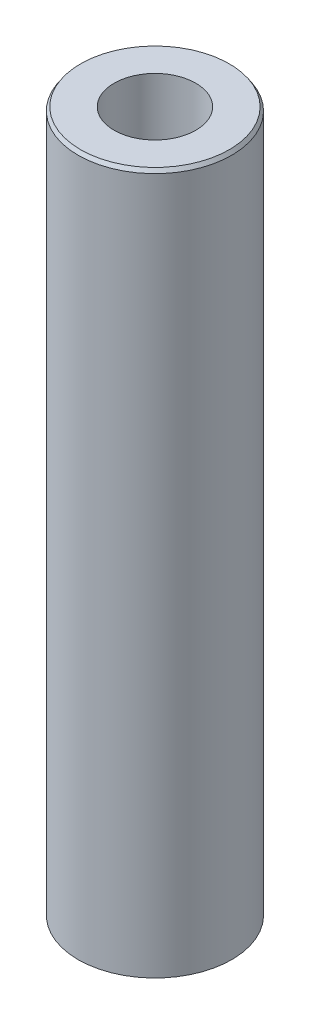
ISO-10303-21;
HEADER;
FILE_DESCRIPTION(('STEP AP214'),'2;1');
FILE_NAME('part.step','',(''),(''),'','','');
FILE_SCHEMA(('AUTOMOTIVE_DESIGN { 1 0 10303 214 1 1 1 1 }'));
ENDSEC;
DATA;
#1=APPLICATION_CONTEXT('core data for automotive mechanical design processes');
#2=APPLICATION_PROTOCOL_DEFINITION('international standard','automotive_design',2000,#1);
#3=PRODUCT_CONTEXT('',#1,'mechanical');
#4=PRODUCT('Part','Part','',(#3));
#5=PRODUCT_RELATED_PRODUCT_CATEGORY('part','',(#4));
#6=PRODUCT_DEFINITION_FORMATION('','',#4);
#7=PRODUCT_DEFINITION_CONTEXT('part definition',#1,'design');
#8=PRODUCT_DEFINITION('design','',#6,#7);
#9=PRODUCT_DEFINITION_SHAPE('','',#8);
#10=(LENGTH_UNIT() NAMED_UNIT(*) SI_UNIT(.MILLI.,.METRE.));
#11=(NAMED_UNIT(*) PLANE_ANGLE_UNIT() SI_UNIT($,.RADIAN.));
#12=(NAMED_UNIT(*) SI_UNIT($,.STERADIAN.) SOLID_ANGLE_UNIT());
#13=UNCERTAINTY_MEASURE_WITH_UNIT(LENGTH_MEASURE(1.E-05),#10,'distance_accuracy_value','');
#14=(GEOMETRIC_REPRESENTATION_CONTEXT(3) GLOBAL_UNCERTAINTY_ASSIGNED_CONTEXT((#13)) GLOBAL_UNIT_ASSIGNED_CONTEXT((#10,
#11,#12)) REPRESENTATION_CONTEXT('',''));
#15=CARTESIAN_POINT('',(0.,0.,0.));
#16=DIRECTION('',(0.,0.,1.));
#17=DIRECTION('',(1.,0.,0.));
#18=AXIS2_PLACEMENT_3D('',#15,#16,#17);
#19=CARTESIAN_POINT('',(0.,503.185772735414,0.));
#20=DIRECTION('',(0.,-1.,0.));
#21=DIRECTION('',(0.,0.,-1.));
#22=AXIS2_PLACEMENT_3D('',#19,#20,#21);
#23=CYLINDRICAL_SURFACE('',#22,55.);
#24=CARTESIAN_POINT('',(0.,500.571484464106,0.));
#25=DIRECTION('',(0.,1.,0.));
#26=DIRECTION('',(0.,0.,1.));
#27=AXIS2_PLACEMENT_3D('',#24,#25,#26);
#28=CIRCLE('',#27,55.);
#29=CARTESIAN_POINT('',(0.,500.571484464106,55.));
#30=VERTEX_POINT('',#29);
#31=EDGE_CURVE('E50',#30,#30,#28,.F.);
#32=ORIENTED_EDGE('',*,*,#31,.T.);
#33=EDGE_LOOP('',(#32));
#34=FACE_BOUND('',#33,.T.);
#35=CARTESIAN_POINT('',(0.,1.73448984605251,0.));
#36=DIRECTION('',(0.,1.,0.));
#37=DIRECTION('',(0.,0.,1.));
#38=AXIS2_PLACEMENT_3D('',#35,#36,#37);
#39=CIRCLE('',#38,55.);
#40=CARTESIAN_POINT('',(0.,1.73448984605251,55.));
#41=VERTEX_POINT('',#40);
#42=EDGE_CURVE('E51',#41,#41,#39,.T.);
#43=ORIENTED_EDGE('',*,*,#42,.T.);
#44=EDGE_LOOP('',(#43));
#45=FACE_BOUND('',#44,.T.);
#46=ADVANCED_FACE('F39',(#34,#45),#23,.T.);
#47=CARTESIAN_POINT('',(0.,503.185772735414,0.));
#48=DIRECTION('',(0.,1.,0.));
#49=DIRECTION('',(0.,0.,1.));
#50=AXIS2_PLACEMENT_3D('',#47,#48,#49);
#51=PLANE('',#50);
#52=CARTESIAN_POINT('',(0.,503.185772735414,0.));
#53=DIRECTION('',(0.,1.,0.));
#54=DIRECTION('',(0.,0.,1.));
#55=AXIS2_PLACEMENT_3D('',#52,#53,#54);
#56=CIRCLE('',#55,53.2655101539474);
#57=CARTESIAN_POINT('',(0.,503.185772735414,53.2655101539474));
#58=VERTEX_POINT('',#57);
#59=EDGE_CURVE('E54',#58,#58,#56,.T.);
#60=ORIENTED_EDGE('',*,*,#59,.T.);
#61=EDGE_LOOP('',(#60));
#62=FACE_BOUND('',#61,.T.);
#63=CARTESIAN_POINT('',(0.,503.185772735414,0.));
#64=DIRECTION('',(0.,1.,0.));
#65=DIRECTION('',(0.,0.,1.));
#66=AXIS2_PLACEMENT_3D('',#63,#64,#65);
#67=CIRCLE('',#66,29.235943878737);
#68=CARTESIAN_POINT('',(0.,503.185772735414,29.235943878737));
#69=VERTEX_POINT('',#68);
#70=EDGE_CURVE('E58',#69,#69,#67,.T.);
#71=ORIENTED_EDGE('',*,*,#70,.F.);
#72=EDGE_LOOP('',(#71));
#73=FACE_BOUND('',#72,.T.);
#74=ADVANCED_FACE('F69',(#62,#73),#51,.T.);
#75=CARTESIAN_POINT('',(0.,0.,0.));
#76=DIRECTION('',(0.,1.,0.));
#77=DIRECTION('',(0.,0.,1.));
#78=AXIS2_PLACEMENT_3D('',#75,#76,#77);
#79=PLANE('',#78);
#80=CARTESIAN_POINT('',(0.,0.,0.));
#81=DIRECTION('',(0.,1.,0.));
#82=DIRECTION('',(0.,0.,1.));
#83=AXIS2_PLACEMENT_3D('',#80,#81,#82);
#84=CIRCLE('',#83,52.3857117286925);
#85=CARTESIAN_POINT('',(0.,0.,52.3857117286925));
#86=VERTEX_POINT('',#85);
#87=EDGE_CURVE('E10',#86,#86,#84,.F.);
#88=ORIENTED_EDGE('',*,*,#87,.T.);
#89=EDGE_LOOP('',(#88));
#90=FACE_BOUND('',#89,.T.);
#91=CARTESIAN_POINT('',(0.,0.,0.));
#92=DIRECTION('',(0.,1.,0.));
#93=DIRECTION('',(0.,0.,1.));
#94=AXIS2_PLACEMENT_3D('',#91,#92,#93);
#95=CIRCLE('',#94,29.235943878737);
#96=CARTESIAN_POINT('',(0.,0.,29.235943878737));
#97=VERTEX_POINT('',#96);
#98=EDGE_CURVE('E63',#97,#97,#95,.T.);
#99=ORIENTED_EDGE('',*,*,#98,.T.);
#100=EDGE_LOOP('',(#99));
#101=FACE_BOUND('',#100,.T.);
#102=ADVANCED_FACE('F75',(#90,#101),#79,.F.);
#103=CARTESIAN_POINT('',(0.,503.185772735414,0.));
#104=DIRECTION('',(0.,-1.,0.));
#105=DIRECTION('',(0.,0.,-1.));
#106=AXIS2_PLACEMENT_3D('',#103,#104,#105);
#107=CYLINDRICAL_SURFACE('',#106,29.235943878737);
#108=ORIENTED_EDGE('',*,*,#70,.T.);
#109=EDGE_LOOP('',(#108));
#110=FACE_BOUND('',#109,.T.);
#111=ORIENTED_EDGE('',*,*,#98,.F.);
#112=EDGE_LOOP('',(#111));
#113=FACE_BOUND('',#112,.T.);
#114=ADVANCED_FACE('F70',(#110,#113),#107,.F.);
#115=CARTESIAN_POINT('',(0.,503.185772735414,0.));
#116=DIRECTION('',(0.,-1.,0.));
#117=DIRECTION('',(0.,0.,-1.));
#118=AXIS2_PLACEMENT_3D('',#115,#116,#117);
#119=CONICAL_SURFACE('',#118,53.2655101539474,0.585783074874268);
#120=ORIENTED_EDGE('',*,*,#31,.F.);
#121=EDGE_LOOP('',(#120));
#122=FACE_BOUND('',#121,.T.);
#123=ORIENTED_EDGE('',*,*,#59,.F.);
#124=EDGE_LOOP('',(#123));
#125=FACE_BOUND('',#124,.T.);
#126=ADVANCED_FACE('F81',(#122,#125),#119,.T.);
#127=CARTESIAN_POINT('',(0.,1.73448984605251,0.));
#128=DIRECTION('',(0.,1.,0.));
#129=DIRECTION('',(0.,0.,1.));
#130=AXIS2_PLACEMENT_3D('',#127,#128,#129);
#131=CONICAL_SURFACE('',#130,55.,0.985013251920641);
#132=CARTESIAN_POINT('',(0.,0.,52.3857117286925));
#133=CARTESIAN_POINT('',(0.,0.0180676025630485,52.4129438981853));
#134=CARTESIAN_POINT('',(0.,0.0361352051260949,52.4401760676781));
#135=CARTESIAN_POINT('',(0.,0.0722704102521877,52.4946404066636));
#136=CARTESIAN_POINT('',(0.,0.0903380128152341,52.5218725761564));
#137=CARTESIAN_POINT('',(0.,0.126473217941328,52.576336915142));
#138=CARTESIAN_POINT('',(0.,0.144540820504376,52.6035690846348));
#139=CARTESIAN_POINT('',(0.,0.18067602563047,52.6580334236204));
#140=CARTESIAN_POINT('',(0.,0.198743628193516,52.6852655931132));
#141=CARTESIAN_POINT('',(0.,0.23487883331961,52.7397299320987));
#142=CARTESIAN_POINT('',(0.,0.252946435882658,52.7669621015915));
#143=CARTESIAN_POINT('',(0.,0.289081641008752,52.8214264405771));
#144=CARTESIAN_POINT('',(0.,0.307149243571798,52.8486586100699));
#145=CARTESIAN_POINT('',(0.,0.343284448697892,52.9031229490554));
#146=CARTESIAN_POINT('',(0.,0.36135205126094,52.9303551185482));
#147=CARTESIAN_POINT('',(0.,0.397487256387034,52.9848194575338));
#148=CARTESIAN_POINT('',(0.,0.41555485895008,53.0120516270266));
#149=CARTESIAN_POINT('',(0.,0.451690064076174,53.0665159660122));
#150=CARTESIAN_POINT('',(0.,0.469757666639222,53.093748135505));
#151=CARTESIAN_POINT('',(0.,0.505892871765316,53.1482124744905));
#152=CARTESIAN_POINT('',(0.,0.523960474328362,53.1754446439833));
#153=CARTESIAN_POINT('',(0.,0.560095679454456,53.2299089829689));
#154=CARTESIAN_POINT('',(0.,0.578163282017504,53.2571411524617));
#155=CARTESIAN_POINT('',(0.,0.614298487143598,53.3116054914472));
#156=CARTESIAN_POINT('',(0.,0.632366089706644,53.33883766094));
#157=CARTESIAN_POINT('',(0.,0.668501294832738,53.3933019999256));
#158=CARTESIAN_POINT('',(0.,0.686568897395786,53.4205341694184));
#159=CARTESIAN_POINT('',(0.,0.72270410252188,53.474998508404));
#160=CARTESIAN_POINT('',(0.,0.740771705084926,53.5022306778967));
#161=CARTESIAN_POINT('',(0.,0.77690691021102,53.5566950168823));
#162=CARTESIAN_POINT('',(0.,0.794974512774068,53.5839271863751));
#163=CARTESIAN_POINT('',(0.,0.831109717900162,53.6383915253607));
#164=CARTESIAN_POINT('',(0.,0.849177320463208,53.6656236948535));
#165=CARTESIAN_POINT('',(0.,0.885312525589302,53.720088033839));
#166=CARTESIAN_POINT('',(0.,0.90338012815235,53.7473202033318));
#167=CARTESIAN_POINT('',(0.,0.939515333278444,53.8017845423174));
#168=CARTESIAN_POINT('',(0.,0.95758293584149,53.8290167118102));
#169=CARTESIAN_POINT('',(0.,0.993718140967584,53.8834810507958));
#170=CARTESIAN_POINT('',(0.,1.01178574353063,53.9107132202885));
#171=CARTESIAN_POINT('',(0.,1.04792094865673,53.9651775592741));
#172=CARTESIAN_POINT('',(0.,1.06598855121977,53.9924097287669));
#173=CARTESIAN_POINT('',(0.,1.10212375634587,54.0468740677525));
#174=CARTESIAN_POINT('',(0.,1.12019135890891,54.0741062372453));
#175=CARTESIAN_POINT('',(0.,1.15632656403501,54.1285705762308));
#176=CARTESIAN_POINT('',(0.,1.17439416659805,54.1558027457236));
#177=CARTESIAN_POINT('',(0.,1.21052937172415,54.2102670847092));
#178=CARTESIAN_POINT('',(0.,1.2285969742872,54.237499254202));
#179=CARTESIAN_POINT('',(0.,1.26473217941329,54.2919635931876));
#180=CARTESIAN_POINT('',(0.,1.28279978197634,54.3191957626803));
#181=CARTESIAN_POINT('',(0.,1.31893498710243,54.3736601016659));
#182=CARTESIAN_POINT('',(0.,1.33700258966548,54.4008922711587));
#183=CARTESIAN_POINT('',(0.,1.37313779479157,54.4553566101443));
#184=CARTESIAN_POINT('',(0.,1.39120539735462,54.4825887796371));
#185=CARTESIAN_POINT('',(0.,1.42734060248071,54.5370531186226));
#186=CARTESIAN_POINT('',(0.,1.44540820504376,54.5642852881154));
#187=CARTESIAN_POINT('',(0.,1.48154341016985,54.618749627101));
#188=CARTESIAN_POINT('',(0.,1.4996110127329,54.6459817965938));
#189=CARTESIAN_POINT('',(0.,1.53574621785899,54.7004461355793));
#190=CARTESIAN_POINT('',(0.,1.55381382042204,54.7276783050721));
#191=CARTESIAN_POINT('',(0.,1.58994902554814,54.7821426440577));
#192=CARTESIAN_POINT('',(0.,1.60801662811118,54.8093748135505));
#193=CARTESIAN_POINT('',(0.,1.64415183323728,54.8638391525361));
#194=CARTESIAN_POINT('',(0.,1.66221943580032,54.8910713220289));
#195=CARTESIAN_POINT('',(0.,1.69835464092642,54.9455356610144));
#196=CARTESIAN_POINT('',(0.,1.71642224348947,54.9727678305072));
#197=CARTESIAN_POINT('',(0.,1.73448984605251,55.));
#198=B_SPLINE_CURVE_WITH_KNOTS('',3,(#132,#133,#134,#135,#136,#137,#138,#139,#140,#141,#142,
#143,#144,#145,#146,#147,#148,#149,#150,#151,#152,#153,#154,#155,#156,#157,#158,#159,#160,#161,
#162,#163,#164,#165,#166,#167,#168,#169,#170,#171,#172,#173,#174,#175,#176,#177,#178,#179,#180,
#181,#182,#183,#184,#185,#186,#187,#188,#189,#190,#191,#192,#193,#194,#195,#196,#197),
.UNSPECIFIED.,.F.,.F.,(4,2,2,2,2,2,2,2,2,2,2,2,2,2,2,2,2,2,2,2,2,2,2,2,2,2,2,2,2,2,2,2,4),(0.,
0.0980421534797154,0.196084306959437,0.294126460439152,0.392168613918873,0.490210767398588,
0.588252920878309,0.686295074358025,0.784337227837746,0.882379381317461,0.980421534797183,
1.0784636882769,1.17650584175662,1.27454799523633,1.37259014871606,1.47063230219577,
1.56867445567549,1.66671660915521,1.76475876263493,1.86280091611464,1.96084306959436,
2.05888522307408,2.1569273765538,2.25496953003352,2.35301168351324,2.45105383699295,
2.54909599047267,2.64713814395239,2.74518029743211,2.84322245091183,2.94126460439155,
3.03930675787126,3.13734891135098),.UNSPECIFIED.);
#199=EDGE_CURVE('BSEAM45',#86,#41,#198,.T.);
#200=ORIENTED_EDGE('',*,*,#87,.F.);
#201=ORIENTED_EDGE('',*,*,#42,.F.);
#202=ORIENTED_EDGE('',*,*,#199,.T.);
#203=ORIENTED_EDGE('',*,*,#199,.F.);
#204=EDGE_LOOP('',(#200,#202,#201,#203));
#205=FACE_BOUND('',#204,.T.);
#206=ADVANCED_FACE('F45',(#205),#131,.T.);
#207=CLOSED_SHELL('',(#46,#74,#102,#114,#126,#206));
#208=MANIFOLD_SOLID_BREP('B2',#207);
#209=ADVANCED_BREP_SHAPE_REPRESENTATION('',(#18,#208),#14);
#210=SHAPE_DEFINITION_REPRESENTATION(#9,#209);
ENDSEC;
END-ISO-10303-21;
